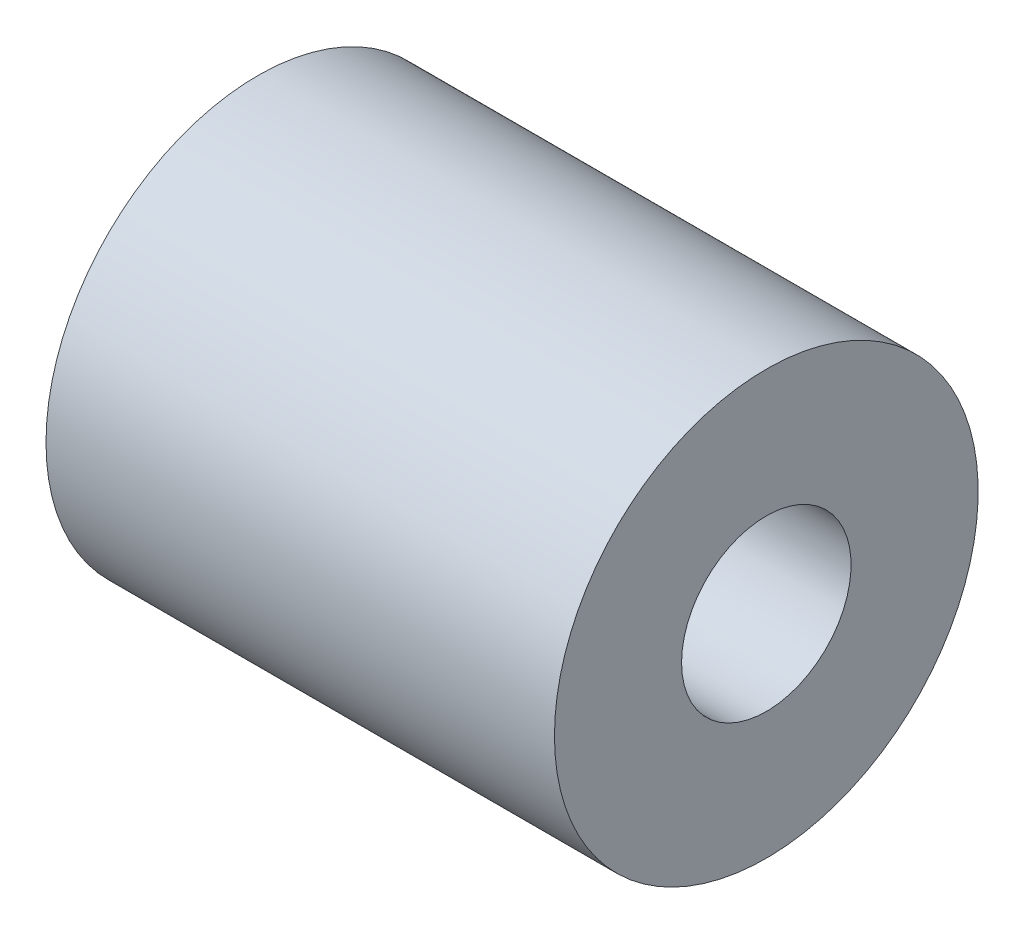
ISO-10303-21;
HEADER;
FILE_DESCRIPTION(('STEP AP214'),'2;1');
FILE_NAME('part.step','',(''),(''),'','','');
FILE_SCHEMA(('AUTOMOTIVE_DESIGN { 1 0 10303 214 1 1 1 1 }'));
ENDSEC;
DATA;
#1=APPLICATION_CONTEXT('core data for automotive mechanical design processes');
#2=APPLICATION_PROTOCOL_DEFINITION('international standard','automotive_design',2000,#1);
#3=PRODUCT_CONTEXT('',#1,'mechanical');
#4=PRODUCT('Part','Part','',(#3));
#5=PRODUCT_RELATED_PRODUCT_CATEGORY('part','',(#4));
#6=PRODUCT_DEFINITION_FORMATION('','',#4);
#7=PRODUCT_DEFINITION_CONTEXT('part definition',#1,'design');
#8=PRODUCT_DEFINITION('design','',#6,#7);
#9=PRODUCT_DEFINITION_SHAPE('','',#8);
#10=(LENGTH_UNIT() NAMED_UNIT(*) SI_UNIT(.MILLI.,.METRE.));
#11=(NAMED_UNIT(*) PLANE_ANGLE_UNIT() SI_UNIT($,.RADIAN.));
#12=(NAMED_UNIT(*) SI_UNIT($,.STERADIAN.) SOLID_ANGLE_UNIT());
#13=UNCERTAINTY_MEASURE_WITH_UNIT(LENGTH_MEASURE(1.E-05),#10,'distance_accuracy_value','');
#14=(GEOMETRIC_REPRESENTATION_CONTEXT(3) GLOBAL_UNCERTAINTY_ASSIGNED_CONTEXT((#13)) GLOBAL_UNIT_ASSIGNED_CONTEXT((#10,
#11,#12)) REPRESENTATION_CONTEXT('',''));
#15=CARTESIAN_POINT('',(0.,0.,0.));
#16=DIRECTION('',(0.,0.,1.));
#17=DIRECTION('',(1.,0.,0.));
#18=AXIS2_PLACEMENT_3D('',#15,#16,#17);
#19=CARTESIAN_POINT('',(-6.46007531549211,0.,0.));
#20=DIRECTION('',(-1.,0.,0.));
#21=DIRECTION('',(0.,0.,1.));
#22=AXIS2_PLACEMENT_3D('',#19,#20,#21);
#23=CYLINDRICAL_SURFACE('',#22,1.);
#24=CARTESIAN_POINT('',(0.,0.,0.));
#25=DIRECTION('',(-1.,0.,0.));
#26=DIRECTION('',(0.,0.,1.));
#27=AXIS2_PLACEMENT_3D('',#24,#25,#26);
#28=CIRCLE('',#27,1.);
#29=CARTESIAN_POINT('',(0.,0.,1.));
#30=VERTEX_POINT('',#29);
#31=EDGE_CURVE('E50',#30,#30,#28,.T.);
#32=ORIENTED_EDGE('',*,*,#31,.F.);
#33=EDGE_LOOP('',(#32));
#34=FACE_BOUND('',#33,.T.);
#35=CARTESIAN_POINT('',(-6.92500000000001,0.,0.));
#36=DIRECTION('',(-1.,0.,0.));
#37=DIRECTION('',(0.,0.,1.));
#38=AXIS2_PLACEMENT_3D('',#35,#36,#37);
#39=CIRCLE('',#38,0.999999999999999);
#40=CARTESIAN_POINT('',(-6.92500000000001,0.,0.999999999999999));
#41=VERTEX_POINT('',#40);
#42=EDGE_CURVE('E10',#41,#41,#39,.T.);
#43=ORIENTED_EDGE('',*,*,#42,.T.);
#44=EDGE_LOOP('',(#43));
#45=FACE_BOUND('',#44,.T.);
#46=ADVANCED_FACE('F31',(#34,#45),#23,.F.);
#47=CARTESIAN_POINT('',(-6.,0.,0.));
#48=DIRECTION('',(1.,0.,0.));
#49=DIRECTION('',(0.,0.,-1.));
#50=AXIS2_PLACEMENT_3D('',#47,#48,#49);
#51=CONICAL_SURFACE('',#50,1.925,0.785398163397443);
#52=ORIENTED_EDGE('',*,*,#42,.F.);
#53=EDGE_LOOP('',(#52));
#54=FACE_BOUND('',#53,.T.);
#55=CARTESIAN_POINT('',(-6.,0.,0.));
#56=DIRECTION('',(-1.,0.,0.));
#57=DIRECTION('',(0.,0.,1.));
#58=AXIS2_PLACEMENT_3D('',#55,#56,#57);
#59=CIRCLE('',#58,1.925);
#60=CARTESIAN_POINT('',(-6.,0.,1.925));
#61=VERTEX_POINT('',#60);
#62=EDGE_CURVE('E37',#61,#61,#59,.T.);
#63=ORIENTED_EDGE('',*,*,#62,.T.);
#64=EDGE_LOOP('',(#63));
#65=FACE_BOUND('',#64,.T.);
#66=ADVANCED_FACE('F57',(#54,#65),#51,.T.);
#67=CARTESIAN_POINT('',(-6.,1.925,0.));
#68=DIRECTION('',(1.,0.,0.));
#69=DIRECTION('',(0.,0.,-1.));
#70=AXIS2_PLACEMENT_3D('',#67,#68,#69);
#71=PLANE('',#70);
#72=ORIENTED_EDGE('',*,*,#62,.F.);
#73=EDGE_LOOP('',(#72));
#74=FACE_BOUND('',#73,.T.);
#75=CARTESIAN_POINT('',(-6.,0.,0.));
#76=DIRECTION('',(-1.,0.,0.));
#77=DIRECTION('',(0.,0.,1.));
#78=AXIS2_PLACEMENT_3D('',#75,#76,#77);
#79=CIRCLE('',#78,2.5);
#80=CARTESIAN_POINT('',(-6.,0.,2.5));
#81=VERTEX_POINT('',#80);
#82=EDGE_CURVE('E41',#81,#81,#79,.T.);
#83=ORIENTED_EDGE('',*,*,#82,.T.);
#84=EDGE_LOOP('',(#83));
#85=FACE_BOUND('',#84,.T.);
#86=ADVANCED_FACE('F61',(#74,#85),#71,.F.);
#87=CARTESIAN_POINT('',(-6.46007531549211,0.,0.));
#88=DIRECTION('',(-1.,0.,0.));
#89=DIRECTION('',(0.,0.,1.));
#90=AXIS2_PLACEMENT_3D('',#87,#88,#89);
#91=CYLINDRICAL_SURFACE('',#90,2.5);
#92=ORIENTED_EDGE('',*,*,#82,.F.);
#93=EDGE_LOOP('',(#92));
#94=FACE_BOUND('',#93,.T.);
#95=CARTESIAN_POINT('',(0.,0.,0.));
#96=DIRECTION('',(-1.,0.,0.));
#97=DIRECTION('',(0.,0.,1.));
#98=AXIS2_PLACEMENT_3D('',#95,#96,#97);
#99=CIRCLE('',#98,2.5);
#100=CARTESIAN_POINT('',(0.,0.,2.5));
#101=VERTEX_POINT('',#100);
#102=EDGE_CURVE('E45',#101,#101,#99,.T.);
#103=ORIENTED_EDGE('',*,*,#102,.T.);
#104=EDGE_LOOP('',(#103));
#105=FACE_BOUND('',#104,.T.);
#106=ADVANCED_FACE('F66',(#94,#105),#91,.T.);
#107=CARTESIAN_POINT('',(0.,2.5,0.));
#108=DIRECTION('',(-1.,0.,0.));
#109=DIRECTION('',(0.,0.,1.));
#110=AXIS2_PLACEMENT_3D('',#107,#108,#109);
#111=PLANE('',#110);
#112=ORIENTED_EDGE('',*,*,#102,.F.);
#113=EDGE_LOOP('',(#112));
#114=FACE_BOUND('',#113,.T.);
#115=ORIENTED_EDGE('',*,*,#31,.T.);
#116=EDGE_LOOP('',(#115));
#117=FACE_BOUND('',#116,.T.);
#118=ADVANCED_FACE('F54',(#114,#117),#111,.F.);
#119=CLOSED_SHELL('',(#46,#66,#86,#106,#118));
#120=MANIFOLD_SOLID_BREP('B2',#119);
#121=ADVANCED_BREP_SHAPE_REPRESENTATION('',(#18,#120),#14);
#122=SHAPE_DEFINITION_REPRESENTATION(#9,#121);
ENDSEC;
END-ISO-10303-21;
